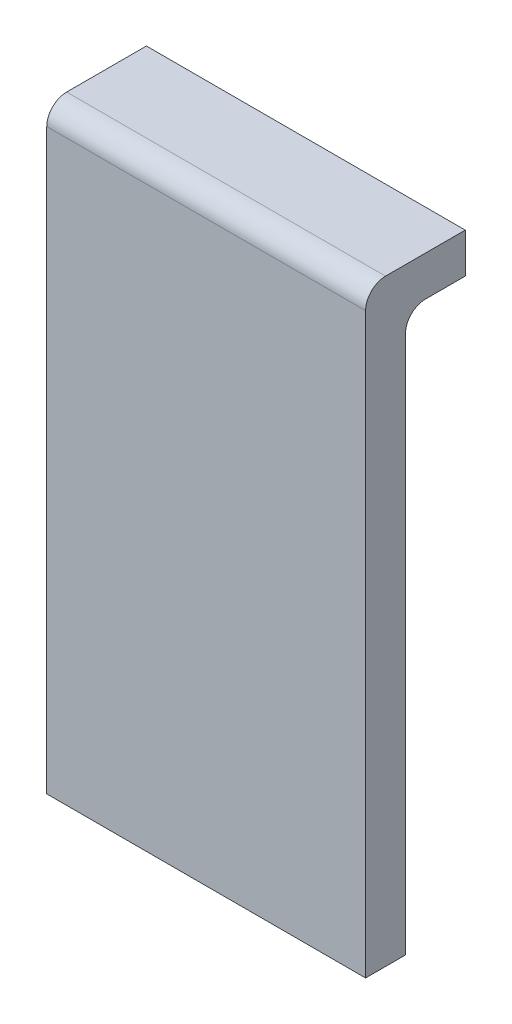
ISO-10303-21;
HEADER;
FILE_DESCRIPTION(('STEP AP214'),'2;1');
FILE_NAME('part.step','',(''),(''),'','','');
FILE_SCHEMA(('AUTOMOTIVE_DESIGN { 1 0 10303 214 1 1 1 1 }'));
ENDSEC;
DATA;
#1=APPLICATION_CONTEXT('core data for automotive mechanical design processes');
#2=APPLICATION_PROTOCOL_DEFINITION('international standard','automotive_design',2000,#1);
#3=PRODUCT_CONTEXT('',#1,'mechanical');
#4=PRODUCT('Part','Part','',(#3));
#5=PRODUCT_RELATED_PRODUCT_CATEGORY('part','',(#4));
#6=PRODUCT_DEFINITION_FORMATION('','',#4);
#7=PRODUCT_DEFINITION_CONTEXT('part definition',#1,'design');
#8=PRODUCT_DEFINITION('design','',#6,#7);
#9=PRODUCT_DEFINITION_SHAPE('','',#8);
#10=(LENGTH_UNIT() NAMED_UNIT(*) SI_UNIT(.MILLI.,.METRE.));
#11=(NAMED_UNIT(*) PLANE_ANGLE_UNIT() SI_UNIT($,.RADIAN.));
#12=(NAMED_UNIT(*) SI_UNIT($,.STERADIAN.) SOLID_ANGLE_UNIT());
#13=UNCERTAINTY_MEASURE_WITH_UNIT(LENGTH_MEASURE(1.E-05),#10,'distance_accuracy_value','');
#14=(GEOMETRIC_REPRESENTATION_CONTEXT(3) GLOBAL_UNCERTAINTY_ASSIGNED_CONTEXT((#13)) GLOBAL_UNIT_ASSIGNED_CONTEXT((#10,
#11,#12)) REPRESENTATION_CONTEXT('',''));
#15=CARTESIAN_POINT('',(0.,0.,0.));
#16=DIRECTION('',(0.,0.,1.));
#17=DIRECTION('',(1.,0.,0.));
#18=AXIS2_PLACEMENT_3D('',#15,#16,#17);
#19=CARTESIAN_POINT('',(0.,0.,-0.2));
#20=DIRECTION('',(-1.,0.,0.));
#21=DIRECTION('',(0.,0.,1.));
#22=AXIS2_PLACEMENT_3D('',#19,#20,#21);
#23=PLANE('',#22);
#24=DIRECTION('',(0.,-1.,0.));
#25=VECTOR('',#24,1.);
#26=CARTESIAN_POINT('',(0.,0.,0.));
#27=LINE('',#26,#25);
#28=CARTESIAN_POINT('',(0.,2.9,0.));
#29=VERTEX_POINT('',#28);
#30=CARTESIAN_POINT('',(0.,0.,0.));
#31=VERTEX_POINT('',#30);
#32=EDGE_CURVE('E119',#29,#31,#27,.T.);
#33=ORIENTED_EDGE('',*,*,#32,.F.);
#34=CARTESIAN_POINT('',(0.,2.9,-0.1));
#35=DIRECTION('',(-1.,0.,0.));
#36=DIRECTION('',(0.,0.,1.));
#37=AXIS2_PLACEMENT_3D('',#34,#35,#36);
#38=CIRCLE('',#37,0.1);
#39=CARTESIAN_POINT('',(0.,3.,-0.1));
#40=VERTEX_POINT('',#39);
#41=EDGE_CURVE('E132',#29,#40,#38,.T.);
#42=ORIENTED_EDGE('',*,*,#41,.T.);
#43=DIRECTION('',(0.,0.,1.));
#44=VECTOR('',#43,1.);
#45=CARTESIAN_POINT('',(0.,3.,-0.2));
#46=LINE('',#45,#44);
#47=CARTESIAN_POINT('',(0.,3.,-0.5));
#48=VERTEX_POINT('',#47);
#49=EDGE_CURVE('E133',#48,#40,#46,.T.);
#50=ORIENTED_EDGE('',*,*,#49,.F.);
#51=DIRECTION('',(0.,1.,0.));
#52=VECTOR('',#51,1.);
#53=CARTESIAN_POINT('',(0.,3.,-0.5));
#54=LINE('',#53,#52);
#55=CARTESIAN_POINT('',(0.,2.8,-0.5));
#56=VERTEX_POINT('',#55);
#57=EDGE_CURVE('E108',#56,#48,#54,.T.);
#58=ORIENTED_EDGE('',*,*,#57,.F.);
#59=DIRECTION('',(0.,0.,1.));
#60=VECTOR('',#59,1.);
#61=CARTESIAN_POINT('',(0.,2.8,-0.5));
#62=LINE('',#61,#60);
#63=CARTESIAN_POINT('',(0.,2.8,-0.3));
#64=VERTEX_POINT('',#63);
#65=EDGE_CURVE('E104',#56,#64,#62,.T.);
#66=ORIENTED_EDGE('',*,*,#65,.T.);
#67=CARTESIAN_POINT('',(0.,2.7,-0.3));
#68=DIRECTION('',(-1.,0.,0.));
#69=DIRECTION('',(0.,0.,1.));
#70=AXIS2_PLACEMENT_3D('',#67,#68,#69);
#71=CIRCLE('',#70,0.1);
#72=CARTESIAN_POINT('',(0.,2.7,-0.2));
#73=VERTEX_POINT('',#72);
#74=EDGE_CURVE('E40',#64,#73,#71,.F.);
#75=ORIENTED_EDGE('',*,*,#74,.T.);
#76=DIRECTION('',(0.,-1.,0.));
#77=VECTOR('',#76,1.);
#78=CARTESIAN_POINT('',(0.,0.,-0.2));
#79=LINE('',#78,#77);
#80=CARTESIAN_POINT('',(0.,0.,-0.2));
#81=VERTEX_POINT('',#80);
#82=EDGE_CURVE('E134',#73,#81,#79,.T.);
#83=ORIENTED_EDGE('',*,*,#82,.T.);
#84=DIRECTION('',(0.,0.,1.));
#85=VECTOR('',#84,1.);
#86=CARTESIAN_POINT('',(0.,0.,-0.2));
#87=LINE('',#86,#85);
#88=EDGE_CURVE('E151',#81,#31,#87,.T.);
#89=ORIENTED_EDGE('',*,*,#88,.T.);
#90=EDGE_LOOP('',(#33,#42,#50,#58,#66,#75,#83,#89));
#91=FACE_BOUND('',#90,.T.);
#92=ADVANCED_FACE('F32',(#91),#23,.T.);
#93=CARTESIAN_POINT('',(0.,3.,-0.2));
#94=DIRECTION('',(0.,1.,0.));
#95=DIRECTION('',(-1.,0.,0.));
#96=AXIS2_PLACEMENT_3D('',#93,#94,#95);
#97=PLANE('',#96);
#98=ORIENTED_EDGE('',*,*,#49,.T.);
#99=DIRECTION('',(-1.,0.,0.));
#100=VECTOR('',#99,1.);
#101=CARTESIAN_POINT('',(1.6,3.,-0.1));
#102=LINE('',#101,#100);
#103=CARTESIAN_POINT('',(1.6,3.,-0.1));
#104=VERTEX_POINT('',#103);
#105=EDGE_CURVE('E177',#40,#104,#102,.F.);
#106=ORIENTED_EDGE('',*,*,#105,.T.);
#107=DIRECTION('',(0.,0.,1.));
#108=VECTOR('',#107,1.);
#109=CARTESIAN_POINT('',(1.6,3.,-0.2));
#110=LINE('',#109,#108);
#111=CARTESIAN_POINT('',(1.6,3.,-0.5));
#112=VERTEX_POINT('',#111);
#113=EDGE_CURVE('E156',#112,#104,#110,.T.);
#114=ORIENTED_EDGE('',*,*,#113,.F.);
#115=DIRECTION('',(1.,0.,0.));
#116=VECTOR('',#115,1.);
#117=CARTESIAN_POINT('',(1.6,3.,-0.5));
#118=LINE('',#117,#116);
#119=EDGE_CURVE('E115',#48,#112,#118,.T.);
#120=ORIENTED_EDGE('',*,*,#119,.F.);
#121=EDGE_LOOP('',(#98,#106,#114,#120));
#122=FACE_BOUND('',#121,.T.);
#123=ADVANCED_FACE('F190',(#122),#97,.T.);
#124=CARTESIAN_POINT('',(1.6,0.,-0.2));
#125=DIRECTION('',(1.,0.,0.));
#126=DIRECTION('',(0.,0.,-1.));
#127=AXIS2_PLACEMENT_3D('',#124,#125,#126);
#128=PLANE('',#127);
#129=ORIENTED_EDGE('',*,*,#113,.T.);
#130=CARTESIAN_POINT('',(1.6,2.9,-0.1));
#131=DIRECTION('',(1.,0.,0.));
#132=DIRECTION('',(0.,0.,-1.));
#133=AXIS2_PLACEMENT_3D('',#130,#131,#132);
#134=CIRCLE('',#133,0.1);
#135=CARTESIAN_POINT('',(1.6,2.9,0.));
#136=VERTEX_POINT('',#135);
#137=EDGE_CURVE('E173',#104,#136,#134,.T.);
#138=ORIENTED_EDGE('',*,*,#137,.T.);
#139=DIRECTION('',(0.,1.,0.));
#140=VECTOR('',#139,1.);
#141=CARTESIAN_POINT('',(1.6,0.,0.));
#142=LINE('',#141,#140);
#143=CARTESIAN_POINT('',(1.6,0.,0.));
#144=VERTEX_POINT('',#143);
#145=EDGE_CURVE('E138',#144,#136,#142,.T.);
#146=ORIENTED_EDGE('',*,*,#145,.F.);
#147=DIRECTION('',(0.,0.,1.));
#148=VECTOR('',#147,1.);
#149=CARTESIAN_POINT('',(1.6,0.,-0.2));
#150=LINE('',#149,#148);
#151=CARTESIAN_POINT('',(1.6,0.,-0.2));
#152=VERTEX_POINT('',#151);
#153=EDGE_CURVE('E154',#152,#144,#150,.T.);
#154=ORIENTED_EDGE('',*,*,#153,.F.);
#155=DIRECTION('',(0.,1.,0.));
#156=VECTOR('',#155,1.);
#157=CARTESIAN_POINT('',(1.6,0.,-0.2));
#158=LINE('',#157,#156);
#159=CARTESIAN_POINT('',(1.6,2.7,-0.2));
#160=VERTEX_POINT('',#159);
#161=EDGE_CURVE('E146',#152,#160,#158,.T.);
#162=ORIENTED_EDGE('',*,*,#161,.T.);
#163=CARTESIAN_POINT('',(1.6,2.7,-0.3));
#164=DIRECTION('',(1.,0.,0.));
#165=DIRECTION('',(0.,0.,-1.));
#166=AXIS2_PLACEMENT_3D('',#163,#164,#165);
#167=CIRCLE('',#166,0.1);
#168=CARTESIAN_POINT('',(1.6,2.8,-0.3));
#169=VERTEX_POINT('',#168);
#170=EDGE_CURVE('E11',#160,#169,#167,.F.);
#171=ORIENTED_EDGE('',*,*,#170,.T.);
#172=DIRECTION('',(0.,0.,1.));
#173=VECTOR('',#172,1.);
#174=CARTESIAN_POINT('',(1.6,2.8,-0.5));
#175=LINE('',#174,#173);
#176=CARTESIAN_POINT('',(1.6,2.8,-0.5));
#177=VERTEX_POINT('',#176);
#178=EDGE_CURVE('E101',#177,#169,#175,.T.);
#179=ORIENTED_EDGE('',*,*,#178,.F.);
#180=DIRECTION('',(0.,-1.,0.));
#181=VECTOR('',#180,1.);
#182=CARTESIAN_POINT('',(1.6,3.,-0.5));
#183=LINE('',#182,#181);
#184=EDGE_CURVE('E109',#112,#177,#183,.T.);
#185=ORIENTED_EDGE('',*,*,#184,.F.);
#186=EDGE_LOOP('',(#129,#138,#146,#154,#162,#171,#179,#185));
#187=FACE_BOUND('',#186,.T.);
#188=ADVANCED_FACE('F118',(#187),#128,.T.);
#189=CARTESIAN_POINT('',(0.,0.,-0.2));
#190=DIRECTION('',(0.,-1.,0.));
#191=DIRECTION('',(0.,0.,-1.));
#192=AXIS2_PLACEMENT_3D('',#189,#190,#191);
#193=PLANE('',#192);
#194=DIRECTION('',(1.,0.,0.));
#195=VECTOR('',#194,1.);
#196=CARTESIAN_POINT('',(0.,0.,0.));
#197=LINE('',#196,#195);
#198=EDGE_CURVE('E121',#31,#144,#197,.T.);
#199=ORIENTED_EDGE('',*,*,#198,.F.);
#200=ORIENTED_EDGE('',*,*,#88,.F.);
#201=DIRECTION('',(1.,0.,0.));
#202=VECTOR('',#201,1.);
#203=CARTESIAN_POINT('',(0.,0.,-0.2));
#204=LINE('',#203,#202);
#205=EDGE_CURVE('E137',#81,#152,#204,.T.);
#206=ORIENTED_EDGE('',*,*,#205,.T.);
#207=ORIENTED_EDGE('',*,*,#153,.T.);
#208=EDGE_LOOP('',(#199,#200,#206,#207));
#209=FACE_BOUND('',#208,.T.);
#210=ADVANCED_FACE('F170',(#209),#193,.T.);
#211=CARTESIAN_POINT('',(0.,0.,-0.2));
#212=DIRECTION('',(0.,0.,-1.));
#213=DIRECTION('',(-1.,0.,0.));
#214=AXIS2_PLACEMENT_3D('',#211,#212,#213);
#215=PLANE('',#214);
#216=ORIENTED_EDGE('',*,*,#82,.F.);
#217=DIRECTION('',(-1.,0.,0.));
#218=VECTOR('',#217,1.);
#219=CARTESIAN_POINT('',(0.,2.7,-0.2));
#220=LINE('',#219,#218);
#221=EDGE_CURVE('E53',#73,#160,#220,.F.);
#222=ORIENTED_EDGE('',*,*,#221,.T.);
#223=ORIENTED_EDGE('',*,*,#161,.F.);
#224=ORIENTED_EDGE('',*,*,#205,.F.);
#225=EDGE_LOOP('',(#216,#222,#223,#224));
#226=FACE_BOUND('',#225,.T.);
#227=ADVANCED_FACE('F183',(#226),#215,.T.);
#228=CARTESIAN_POINT('',(0.,0.,0.));
#229=DIRECTION('',(0.,0.,-1.));
#230=DIRECTION('',(-1.,0.,0.));
#231=AXIS2_PLACEMENT_3D('',#228,#229,#230);
#232=PLANE('',#231);
#233=ORIENTED_EDGE('',*,*,#145,.T.);
#234=DIRECTION('',(-1.,0.,0.));
#235=VECTOR('',#234,1.);
#236=CARTESIAN_POINT('',(0.,2.9,0.));
#237=LINE('',#236,#235);
#238=EDGE_CURVE('E129',#136,#29,#237,.T.);
#239=ORIENTED_EDGE('',*,*,#238,.T.);
#240=ORIENTED_EDGE('',*,*,#32,.T.);
#241=ORIENTED_EDGE('',*,*,#198,.T.);
#242=EDGE_LOOP('',(#233,#239,#240,#241));
#243=FACE_BOUND('',#242,.T.);
#244=ADVANCED_FACE('F164',(#243),#232,.F.);
#245=CARTESIAN_POINT('',(1.6,2.8,-0.5));
#246=DIRECTION('',(0.,1.,0.));
#247=DIRECTION('',(0.,0.,1.));
#248=AXIS2_PLACEMENT_3D('',#245,#246,#247);
#249=PLANE('',#248);
#250=ORIENTED_EDGE('',*,*,#178,.T.);
#251=DIRECTION('',(-1.,0.,0.));
#252=VECTOR('',#251,1.);
#253=CARTESIAN_POINT('',(1.6,2.8,-0.3));
#254=LINE('',#253,#252);
#255=EDGE_CURVE('E176',#169,#64,#254,.T.);
#256=ORIENTED_EDGE('',*,*,#255,.T.);
#257=ORIENTED_EDGE('',*,*,#65,.F.);
#258=DIRECTION('',(-1.,0.,0.));
#259=VECTOR('',#258,1.);
#260=CARTESIAN_POINT('',(1.6,2.8,-0.5));
#261=LINE('',#260,#259);
#262=EDGE_CURVE('E97',#177,#56,#261,.T.);
#263=ORIENTED_EDGE('',*,*,#262,.F.);
#264=EDGE_LOOP('',(#250,#256,#257,#263));
#265=FACE_BOUND('',#264,.T.);
#266=ADVANCED_FACE('F99',(#265),#249,.F.);
#267=CARTESIAN_POINT('',(0.,0.,-0.5));
#268=DIRECTION('',(0.,0.,-1.));
#269=DIRECTION('',(-1.,0.,0.));
#270=AXIS2_PLACEMENT_3D('',#267,#268,#269);
#271=PLANE('',#270);
#272=ORIENTED_EDGE('',*,*,#184,.T.);
#273=ORIENTED_EDGE('',*,*,#262,.T.);
#274=ORIENTED_EDGE('',*,*,#57,.T.);
#275=ORIENTED_EDGE('',*,*,#119,.T.);
#276=EDGE_LOOP('',(#272,#273,#274,#275));
#277=FACE_BOUND('',#276,.T.);
#278=ADVANCED_FACE('F113',(#277),#271,.T.);
#279=CARTESIAN_POINT('',(0.,2.9,-0.1));
#280=DIRECTION('',(1.,0.,0.));
#281=DIRECTION('',(0.,1.,0.));
#282=AXIS2_PLACEMENT_3D('',#279,#280,#281);
#283=CYLINDRICAL_SURFACE('',#282,0.1);
#284=ORIENTED_EDGE('',*,*,#137,.F.);
#285=ORIENTED_EDGE('',*,*,#105,.F.);
#286=ORIENTED_EDGE('',*,*,#41,.F.);
#287=ORIENTED_EDGE('',*,*,#238,.F.);
#288=EDGE_LOOP('',(#284,#285,#286,#287));
#289=FACE_BOUND('',#288,.T.);
#290=ADVANCED_FACE('F185',(#289),#283,.T.);
#291=CARTESIAN_POINT('',(1.6,2.7,-0.3));
#292=DIRECTION('',(-1.,0.,0.));
#293=DIRECTION('',(0.,0.,1.));
#294=AXIS2_PLACEMENT_3D('',#291,#292,#293);
#295=CYLINDRICAL_SURFACE('',#294,0.1);
#296=ORIENTED_EDGE('',*,*,#170,.F.);
#297=ORIENTED_EDGE('',*,*,#221,.F.);
#298=ORIENTED_EDGE('',*,*,#74,.F.);
#299=ORIENTED_EDGE('',*,*,#255,.F.);
#300=EDGE_LOOP('',(#296,#297,#298,#299));
#301=FACE_BOUND('',#300,.T.);
#302=ADVANCED_FACE('F34',(#301),#295,.F.);
#303=CLOSED_SHELL('',(#92,#123,#188,#210,#227,#244,#266,#278,#290,#302));
#304=MANIFOLD_SOLID_BREP('B2',#303);
#305=ADVANCED_BREP_SHAPE_REPRESENTATION('',(#18,#304),#14);
#306=SHAPE_DEFINITION_REPRESENTATION(#9,#305);
ENDSEC;
END-ISO-10303-21;
